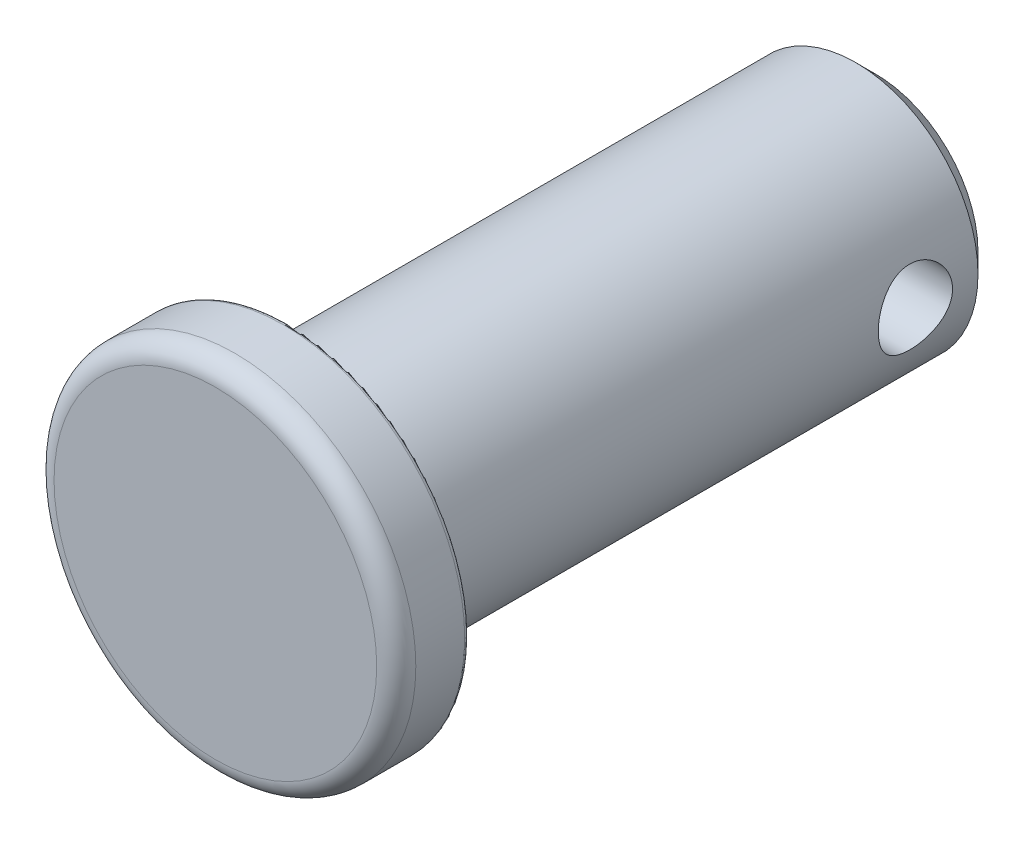
ISO-10303-21;
HEADER;
FILE_DESCRIPTION(('STEP AP214'),'2;1');
FILE_NAME('part.step','',(''),(''),'','','');
FILE_SCHEMA(('AUTOMOTIVE_DESIGN { 1 0 10303 214 1 1 1 1 }'));
ENDSEC;
DATA;
#1=APPLICATION_CONTEXT('core data for automotive mechanical design processes');
#2=APPLICATION_PROTOCOL_DEFINITION('international standard','automotive_design',2000,#1);
#3=PRODUCT_CONTEXT('',#1,'mechanical');
#4=PRODUCT('Part','Part','',(#3));
#5=PRODUCT_RELATED_PRODUCT_CATEGORY('part','',(#4));
#6=PRODUCT_DEFINITION_FORMATION('','',#4);
#7=PRODUCT_DEFINITION_CONTEXT('part definition',#1,'design');
#8=PRODUCT_DEFINITION('design','',#6,#7);
#9=PRODUCT_DEFINITION_SHAPE('','',#8);
#10=(LENGTH_UNIT() NAMED_UNIT(*) SI_UNIT(.MILLI.,.METRE.));
#11=(NAMED_UNIT(*) PLANE_ANGLE_UNIT() SI_UNIT($,.RADIAN.));
#12=(NAMED_UNIT(*) SI_UNIT($,.STERADIAN.) SOLID_ANGLE_UNIT());
#13=UNCERTAINTY_MEASURE_WITH_UNIT(LENGTH_MEASURE(1.E-05),#10,'distance_accuracy_value','');
#14=(GEOMETRIC_REPRESENTATION_CONTEXT(3) GLOBAL_UNCERTAINTY_ASSIGNED_CONTEXT((#13)) GLOBAL_UNIT_ASSIGNED_CONTEXT((#10,
#11,#12)) REPRESENTATION_CONTEXT('',''));
#15=CARTESIAN_POINT('',(0.,0.,0.));
#16=DIRECTION('',(0.,0.,1.));
#17=DIRECTION('',(1.,0.,0.));
#18=AXIS2_PLACEMENT_3D('',#15,#16,#17);
#19=CARTESIAN_POINT('',(0.,2.667,-17.145));
#20=DIRECTION('',(0.,0.,1.));
#21=DIRECTION('',(1.,0.,0.));
#22=AXIS2_PLACEMENT_3D('',#19,#20,#21);
#23=PLANE('',#22);
#24=CARTESIAN_POINT('',(0.,0.,-17.145));
#25=DIRECTION('',(0.,0.,1.));
#26=DIRECTION('',(1.,0.,0.));
#27=AXIS2_PLACEMENT_3D('',#24,#25,#26);
#28=CIRCLE('',#27,2.667);
#29=CARTESIAN_POINT('',(2.667,0.,-17.145));
#30=VERTEX_POINT('',#29);
#31=EDGE_CURVE('E10',#30,#30,#28,.T.);
#32=ORIENTED_EDGE('',*,*,#31,.F.);
#33=EDGE_LOOP('',(#32));
#34=FACE_BOUND('',#33,.T.);
#35=ADVANCED_FACE('F32',(#34),#23,.F.);
#36=CARTESIAN_POINT('',(0.,0.,-17.145));
#37=DIRECTION('',(0.,0.,1.));
#38=DIRECTION('',(1.,0.,0.));
#39=AXIS2_PLACEMENT_3D('',#36,#37,#38);
#40=CONICAL_SURFACE('',#39,2.667,0.78539816339745);
#41=CARTESIAN_POINT('',(0.,0.,-16.637));
#42=DIRECTION('',(0.,0.,1.));
#43=DIRECTION('',(1.,0.,0.));
#44=AXIS2_PLACEMENT_3D('',#41,#42,#43);
#45=CIRCLE('',#44,3.175);
#46=CARTESIAN_POINT('',(3.175,0.,-16.637));
#47=VERTEX_POINT('',#46);
#48=EDGE_CURVE('E43',#47,#47,#45,.T.);
#49=ORIENTED_EDGE('',*,*,#48,.F.);
#50=EDGE_LOOP('',(#49));
#51=FACE_BOUND('',#50,.T.);
#52=ORIENTED_EDGE('',*,*,#31,.T.);
#53=EDGE_LOOP('',(#52));
#54=FACE_BOUND('',#53,.T.);
#55=ADVANCED_FACE('F85',(#51,#54),#40,.T.);
#56=CARTESIAN_POINT('',(0.,0.,0.));
#57=DIRECTION('',(0.,0.,1.));
#58=DIRECTION('',(1.,0.,0.));
#59=AXIS2_PLACEMENT_3D('',#56,#57,#58);
#60=CYLINDRICAL_SURFACE('',#59,3.175);
#61=CARTESIAN_POINT('',(3.175,0.,-15.9766));
#62=CARTESIAN_POINT('',(3.17499960202148,-0.0529171099597264,-15.9765994489505));
#63=CARTESIAN_POINT('',(3.17366446482855,-0.105839807352675,-15.9722338271799));
#64=CARTESIAN_POINT('',(3.16846889178415,-0.21014197840556,-15.9549294973829));
#65=CARTESIAN_POINT('',(3.16460776043548,-0.261521022966031,-15.9419884282142));
#66=CARTESIAN_POINT('',(3.15478287039985,-0.361216525332734,-15.908006720182));
#67=CARTESIAN_POINT('',(3.14882226340518,-0.40953744637008,-15.8869782176925));
#68=CARTESIAN_POINT('',(3.13541665926723,-0.50196744325853,-15.8374689245118));
#69=CARTESIAN_POINT('',(3.12797145297021,-0.546075924355046,-15.8089870836004));
#70=CARTESIAN_POINT('',(3.11214479264708,-0.630125840429245,-15.7444975611919));
#71=CARTESIAN_POINT('',(3.103743765165,-0.669925978102081,-15.7083105430531));
#72=CARTESIAN_POINT('',(3.08706799446787,-0.742996439425313,-15.6298199866198));
#73=CARTESIAN_POINT('',(3.07879327343172,-0.776265628160733,-15.5875153874575));
#74=CARTESIAN_POINT('',(3.06309899900208,-0.836080473160604,-15.4967862419132));
#75=CARTESIAN_POINT('',(3.05570371684317,-0.862452386391713,-15.4482425580905));
#76=CARTESIAN_POINT('',(3.0428987677011,-0.906600393615938,-15.3471481631174));
#77=CARTESIAN_POINT('',(3.0374886094688,-0.924378614595107,-15.2945984472136));
#78=CARTESIAN_POINT('',(3.02947068370596,-0.950322690583481,-15.1885728272399));
#79=CARTESIAN_POINT('',(3.02678700868069,-0.958749553236373,-15.1351666869223));
#80=CARTESIAN_POINT('',(3.02430022666584,-0.966566860643121,-15.0276364102489));
#81=CARTESIAN_POINT('',(3.02449640053699,-0.965959561355332,-14.9735124565139));
#82=CARTESIAN_POINT('',(3.02767996420842,-0.955930519797648,-14.8682169177647));
#83=CARTESIAN_POINT('',(3.0305633238113,-0.946837279944035,-14.8170103750321));
#84=CARTESIAN_POINT('',(3.03862785484783,-0.920625823528376,-14.7168870607177));
#85=CARTESIAN_POINT('',(3.04380925854751,-0.903506795780515,-14.6679705211419));
#86=CARTESIAN_POINT('',(3.0559680411157,-0.861490913100131,-14.5730188964709));
#87=CARTESIAN_POINT('',(3.0629695326536,-0.83648859212139,-14.5270336996585));
#88=CARTESIAN_POINT('',(3.07796818060115,-0.77948913090951,-14.4398022103445));
#89=CARTESIAN_POINT('',(3.08596558363484,-0.747490256585575,-14.3985570965425));
#90=CARTESIAN_POINT('',(3.10247541142566,-0.675780693253499,-14.3201152659527));
#91=CARTESIAN_POINT('',(3.11099520450717,-0.635797838234663,-14.283168469916));
#92=CARTESIAN_POINT('',(3.12728596172095,-0.550097642371093,-14.2164453730147));
#93=CARTESIAN_POINT('',(3.13505687614133,-0.504379921298845,-14.1866695479755));
#94=CARTESIAN_POINT('',(3.14904855416768,-0.408044876414197,-14.1349763498454));
#95=CARTESIAN_POINT('',(3.15525802772192,-0.357395346141192,-14.1131157353477));
#96=CARTESIAN_POINT('',(3.16534578599812,-0.252905754376243,-14.0782977058135));
#97=CARTESIAN_POINT('',(3.16922473905631,-0.199066612457235,-14.0653377381367));
#98=CARTESIAN_POINT('',(3.17410811397315,-0.0918497008877941,-14.0491080126878));
#99=CARTESIAN_POINT('',(3.17521293054221,-0.0385276814501678,-14.0454996616508));
#100=CARTESIAN_POINT('',(3.17471884041293,0.0679641305281534,-14.0471247878636));
#101=CARTESIAN_POINT('',(3.17312030531726,0.121133942984885,-14.0523570498828));
#102=CARTESIAN_POINT('',(3.16746492711847,0.224525218303078,-14.0712417027748));
#103=CARTESIAN_POINT('',(3.16346622012139,0.274786510435966,-14.0846950993332));
#104=CARTESIAN_POINT('',(3.15347486502412,0.372326561352523,-14.1193996379704));
#105=CARTESIAN_POINT('',(3.14748197500806,0.419604957450587,-14.1406517261466));
#106=CARTESIAN_POINT('',(3.13394604455932,0.511073978477804,-14.1909113396242));
#107=CARTESIAN_POINT('',(3.12636983516459,0.555165721875379,-14.2200896475783));
#108=CARTESIAN_POINT('',(3.11053600304834,0.637941803466516,-14.2851667472226));
#109=CARTESIAN_POINT('',(3.10227820535769,0.676624746269282,-14.3210672675773));
#110=CARTESIAN_POINT('',(3.08562471680055,0.748983697946579,-14.4001611706546));
#111=CARTESIAN_POINT('',(3.07723539999955,0.782418659059277,-14.443576903662));
#112=CARTESIAN_POINT('',(3.06159477827646,0.841546870967973,-14.5355851719071));
#113=CARTESIAN_POINT('',(3.05434344692898,0.867240301544484,-14.5841775868917));
#114=CARTESIAN_POINT('',(3.04188247469256,0.90998492163134,-14.6850212346239));
#115=CARTESIAN_POINT('',(3.03666381180963,0.927074401040993,-14.7372550575976));
#116=CARTESIAN_POINT('',(3.02889265300242,0.952160759306612,-14.8440481997207));
#117=CARTESIAN_POINT('',(3.02633921201391,0.960160861264963,-14.8986066874171));
#118=CARTESIAN_POINT('',(3.02428242481225,0.96661829274199,-15.0059913814865));
#119=CARTESIAN_POINT('',(3.02465323006668,0.965469341614603,-15.0587918057839));
#120=CARTESIAN_POINT('',(3.02809958388935,0.954604456015092,-15.1634092265238));
#121=CARTESIAN_POINT('',(3.03117501865302,0.944888882006633,-15.2152262642513));
#122=CARTESIAN_POINT('',(3.03959856215796,0.917423724255598,-15.3157433473823));
#123=CARTESIAN_POINT('',(3.04491637331696,0.899781045503216,-15.3644753314018));
#124=CARTESIAN_POINT('',(3.05721921822302,0.857045987408373,-15.4583265041777));
#125=CARTESIAN_POINT('',(3.06420457754325,0.83195215306395,-15.5034449851311));
#126=CARTESIAN_POINT('',(3.07938049658697,0.773931856895504,-15.59060866113));
#127=CARTESIAN_POINT('',(3.08760628271673,0.740748228480038,-15.6324765335506));
#128=CARTESIAN_POINT('',(3.10416806483213,0.667949903798329,-15.7101771449288));
#129=CARTESIAN_POINT('',(3.11250408915778,0.628333523073051,-15.7460082981103));
#130=CARTESIAN_POINT('',(3.12864996888669,0.542348992657398,-15.8117018512508));
#131=CARTESIAN_POINT('',(3.13643622907422,0.495812639665194,-15.8413505090504));
#132=CARTESIAN_POINT('',(3.15031800168414,0.398179110176869,-15.8923623799248));
#133=CARTESIAN_POINT('',(3.15641426520088,0.347083973155336,-15.9137292753946));
#134=CARTESIAN_POINT('',(3.16573069212427,0.247063057460826,-15.9457698756868));
#135=CARTESIAN_POINT('',(3.16917750158742,0.198431287913334,-15.9572992255072));
#136=CARTESIAN_POINT('',(3.17381214254276,0.0998678490440652,-15.972713868313));
#137=CARTESIAN_POINT('',(3.17500037556131,0.0499364123754632,-15.9766005200102));
#138=CARTESIAN_POINT('',(3.175,0.,-15.9766));
#139=B_SPLINE_CURVE_WITH_KNOTS('',3,(#61,#62,#63,#64,#65,#66,#67,#68,#69,#70,#71,#72,#73,#74,
#75,#76,#77,#78,#79,#80,#81,#82,#83,#84,#85,#86,#87,#88,#89,#90,#91,#92,#93,#94,#95,#96,#97,#98,
#99,#100,#101,#102,#103,#104,#105,#106,#107,#108,#109,#110,#111,#112,#113,#114,#115,#116,#117,
#118,#119,#120,#121,#122,#123,#124,#125,#126,#127,#128,#129,#130,#131,#132,#133,#134,#135,#136,
#137,#138),.UNSPECIFIED.,.T.,.F.,(4,2,2,2,2,2,2,2,2,2,2,2,2,2,2,2,2,2,2,2,2,2,2,2,2,2,2,2,2,2,2,
2,2,2,2,2,2,2,4),(0.,0.158567863518892,0.317179404868527,0.475553849369922,0.633950621809959,
0.7965423613965,0.959162330382842,1.12555213721573,1.29190074054381,1.45347946625597,
1.61501784414631,1.77055128404458,1.9261004474744,2.08382584560656,2.24159038026939,
2.40613001083721,2.5706805563233,2.73638872963979,2.90204935919771,3.06162231521158,
3.22117333811235,3.37700747097253,3.53286051508764,3.69238225025491,3.85194506404332,
4.01746906847746,4.18298922867378,4.34776612032905,4.51248456367862,4.67015410642876,
4.82781701512603,4.98341468860239,5.13904276594956,5.30047374427453,5.46194706274889,
5.62831287823051,5.7946046358815,5.9442673501846,6.09390345518356),.UNSPECIFIED.);
#140=CARTESIAN_POINT('',(3.175,0.,-15.9766));
#141=VERTEX_POINT('',#140);
#142=EDGE_CURVE('E35',#141,#141,#139,.T.);
#143=ORIENTED_EDGE('',*,*,#142,.T.);
#144=EDGE_LOOP('',(#143));
#145=FACE_BOUND('',#144,.T.);
#146=CARTESIAN_POINT('',(-3.175,0.,-15.9766));
#147=CARTESIAN_POINT('',(-3.17499960202148,0.0529171099597264,-15.9765994489505));
#148=CARTESIAN_POINT('',(-3.17366446482855,0.105839807352675,-15.9722338271799));
#149=CARTESIAN_POINT('',(-3.16846889178415,0.21014197840556,-15.9549294973829));
#150=CARTESIAN_POINT('',(-3.16460776043548,0.261521022966031,-15.9419884282142));
#151=CARTESIAN_POINT('',(-3.15478287039985,0.361216525332734,-15.908006720182));
#152=CARTESIAN_POINT('',(-3.14882226340518,0.40953744637008,-15.8869782176925));
#153=CARTESIAN_POINT('',(-3.13541665926723,0.50196744325853,-15.8374689245118));
#154=CARTESIAN_POINT('',(-3.12797145297021,0.546075924355046,-15.8089870836004));
#155=CARTESIAN_POINT('',(-3.11214479264708,0.630125840429245,-15.7444975611919));
#156=CARTESIAN_POINT('',(-3.103743765165,0.669925978102081,-15.7083105430531));
#157=CARTESIAN_POINT('',(-3.08706799446787,0.742996439425313,-15.6298199866198));
#158=CARTESIAN_POINT('',(-3.07879327343172,0.776265628160733,-15.5875153874575));
#159=CARTESIAN_POINT('',(-3.06309899900208,0.836080473160604,-15.4967862419132));
#160=CARTESIAN_POINT('',(-3.05570371684317,0.862452386391713,-15.4482425580905));
#161=CARTESIAN_POINT('',(-3.0428987677011,0.906600393615938,-15.3471481631174));
#162=CARTESIAN_POINT('',(-3.0374886094688,0.924378614595107,-15.2945984472136));
#163=CARTESIAN_POINT('',(-3.02947068370596,0.950322690583481,-15.1885728272399));
#164=CARTESIAN_POINT('',(-3.02678700868069,0.958749553236373,-15.1351666869223));
#165=CARTESIAN_POINT('',(-3.02430022666584,0.966566860643121,-15.0276364102489));
#166=CARTESIAN_POINT('',(-3.02449640053699,0.965959561355332,-14.9735124565139));
#167=CARTESIAN_POINT('',(-3.02767996420842,0.955930519797648,-14.8682169177647));
#168=CARTESIAN_POINT('',(-3.0305633238113,0.946837279944035,-14.8170103750321));
#169=CARTESIAN_POINT('',(-3.03862785484783,0.920625823528376,-14.7168870607177));
#170=CARTESIAN_POINT('',(-3.04380925854751,0.903506795780515,-14.6679705211419));
#171=CARTESIAN_POINT('',(-3.0559680411157,0.861490913100131,-14.5730188964709));
#172=CARTESIAN_POINT('',(-3.0629695326536,0.83648859212139,-14.5270336996585));
#173=CARTESIAN_POINT('',(-3.07796818060115,0.77948913090951,-14.4398022103445));
#174=CARTESIAN_POINT('',(-3.08596558363484,0.747490256585575,-14.3985570965425));
#175=CARTESIAN_POINT('',(-3.10247541142566,0.675780693253499,-14.3201152659527));
#176=CARTESIAN_POINT('',(-3.11099520450717,0.635797838234663,-14.283168469916));
#177=CARTESIAN_POINT('',(-3.12728596172095,0.550097642371093,-14.2164453730147));
#178=CARTESIAN_POINT('',(-3.13505687614133,0.504379921298845,-14.1866695479755));
#179=CARTESIAN_POINT('',(-3.14904855416768,0.408044876414197,-14.1349763498454));
#180=CARTESIAN_POINT('',(-3.15525802772192,0.357395346141192,-14.1131157353477));
#181=CARTESIAN_POINT('',(-3.16534578599812,0.252905754376243,-14.0782977058135));
#182=CARTESIAN_POINT('',(-3.16922473905631,0.199066612457235,-14.0653377381367));
#183=CARTESIAN_POINT('',(-3.17410811397315,0.0918497008877941,-14.0491080126878));
#184=CARTESIAN_POINT('',(-3.17521293054221,0.0385276814501678,-14.0454996616508));
#185=CARTESIAN_POINT('',(-3.17471884041293,-0.0679641305281534,-14.0471247878636));
#186=CARTESIAN_POINT('',(-3.17312030531726,-0.121133942984885,-14.0523570498828));
#187=CARTESIAN_POINT('',(-3.16746492711847,-0.224525218303078,-14.0712417027748));
#188=CARTESIAN_POINT('',(-3.16346622012139,-0.274786510435966,-14.0846950993332));
#189=CARTESIAN_POINT('',(-3.15347486502412,-0.372326561352523,-14.1193996379704));
#190=CARTESIAN_POINT('',(-3.14748197500806,-0.419604957450587,-14.1406517261466));
#191=CARTESIAN_POINT('',(-3.13394604455932,-0.511073978477804,-14.1909113396242));
#192=CARTESIAN_POINT('',(-3.12636983516459,-0.555165721875379,-14.2200896475783));
#193=CARTESIAN_POINT('',(-3.11053600304834,-0.637941803466516,-14.2851667472226));
#194=CARTESIAN_POINT('',(-3.10227820535769,-0.676624746269282,-14.3210672675773));
#195=CARTESIAN_POINT('',(-3.08562471680055,-0.748983697946579,-14.4001611706546));
#196=CARTESIAN_POINT('',(-3.07723539999955,-0.782418659059277,-14.443576903662));
#197=CARTESIAN_POINT('',(-3.06159477827646,-0.841546870967973,-14.5355851719071));
#198=CARTESIAN_POINT('',(-3.05434344692898,-0.867240301544484,-14.5841775868917));
#199=CARTESIAN_POINT('',(-3.04188247469256,-0.90998492163134,-14.6850212346239));
#200=CARTESIAN_POINT('',(-3.03666381180963,-0.927074401040993,-14.7372550575976));
#201=CARTESIAN_POINT('',(-3.02889265300242,-0.952160759306612,-14.8440481997207));
#202=CARTESIAN_POINT('',(-3.02633921201391,-0.960160861264963,-14.8986066874171));
#203=CARTESIAN_POINT('',(-3.02428242481225,-0.96661829274199,-15.0059913814865));
#204=CARTESIAN_POINT('',(-3.02465323006668,-0.965469341614603,-15.0587918057839));
#205=CARTESIAN_POINT('',(-3.02809958388935,-0.954604456015092,-15.1634092265238));
#206=CARTESIAN_POINT('',(-3.03117501865302,-0.944888882006633,-15.2152262642513));
#207=CARTESIAN_POINT('',(-3.03959856215796,-0.917423724255598,-15.3157433473823));
#208=CARTESIAN_POINT('',(-3.04491637331696,-0.899781045503216,-15.3644753314018));
#209=CARTESIAN_POINT('',(-3.05721921822302,-0.857045987408373,-15.4583265041777));
#210=CARTESIAN_POINT('',(-3.06420457754325,-0.83195215306395,-15.5034449851311));
#211=CARTESIAN_POINT('',(-3.07938049658697,-0.773931856895504,-15.59060866113));
#212=CARTESIAN_POINT('',(-3.08760628271673,-0.740748228480038,-15.6324765335506));
#213=CARTESIAN_POINT('',(-3.10416806483213,-0.667949903798329,-15.7101771449288));
#214=CARTESIAN_POINT('',(-3.11250408915778,-0.628333523073051,-15.7460082981103));
#215=CARTESIAN_POINT('',(-3.12864996888669,-0.542348992657398,-15.8117018512508));
#216=CARTESIAN_POINT('',(-3.13643622907422,-0.495812639665194,-15.8413505090504));
#217=CARTESIAN_POINT('',(-3.15031800168414,-0.398179110176869,-15.8923623799248));
#218=CARTESIAN_POINT('',(-3.15641426520088,-0.347083973155336,-15.9137292753946));
#219=CARTESIAN_POINT('',(-3.16573069212427,-0.247063057460826,-15.9457698756868));
#220=CARTESIAN_POINT('',(-3.16917750158742,-0.198431287913334,-15.9572992255072));
#221=CARTESIAN_POINT('',(-3.17381214254276,-0.0998678490440652,-15.972713868313));
#222=CARTESIAN_POINT('',(-3.17500037556131,-0.0499364123754632,-15.9766005200102));
#223=CARTESIAN_POINT('',(-3.175,0.,-15.9766));
#224=B_SPLINE_CURVE_WITH_KNOTS('',3,(#146,#147,#148,#149,#150,#151,#152,#153,#154,#155,#156,
#157,#158,#159,#160,#161,#162,#163,#164,#165,#166,#167,#168,#169,#170,#171,#172,#173,#174,#175,
#176,#177,#178,#179,#180,#181,#182,#183,#184,#185,#186,#187,#188,#189,#190,#191,#192,#193,#194,
#195,#196,#197,#198,#199,#200,#201,#202,#203,#204,#205,#206,#207,#208,#209,#210,#211,#212,#213,
#214,#215,#216,#217,#218,#219,#220,#221,#222,#223),.UNSPECIFIED.,.T.,.F.,(4,2,2,2,2,2,2,2,2,2,2,
2,2,2,2,2,2,2,2,2,2,2,2,2,2,2,2,2,2,2,2,2,2,2,2,2,2,2,4),(0.,0.158567863518892,
0.317179404868527,0.475553849369922,0.633950621809959,0.7965423613965,0.959162330382842,
1.12555213721573,1.29190074054381,1.45347946625597,1.61501784414631,1.77055128404458,
1.9261004474744,2.08382584560656,2.24159038026939,2.40613001083721,2.5706805563233,
2.73638872963979,2.90204935919771,3.06162231521158,3.22117333811235,3.37700747097253,
3.53286051508764,3.69238225025491,3.85194506404332,4.01746906847746,4.18298922867378,
4.34776612032905,4.51248456367862,4.67015410642876,4.82781701512603,4.98341468860239,
5.13904276594956,5.30047374427453,5.46194706274889,5.62831287823051,5.7946046358815,
5.9442673501846,6.09390345518356),.UNSPECIFIED.);
#225=CARTESIAN_POINT('',(-3.175,0.,-15.9766));
#226=VERTEX_POINT('',#225);
#227=EDGE_CURVE('E51',#226,#226,#224,.T.);
#228=ORIENTED_EDGE('',*,*,#227,.T.);
#229=EDGE_LOOP('',(#228));
#230=FACE_BOUND('',#229,.T.);
#231=CARTESIAN_POINT('',(0.,0.,-1.905));
#232=DIRECTION('',(0.,0.,1.));
#233=DIRECTION('',(1.,0.,0.));
#234=AXIS2_PLACEMENT_3D('',#231,#232,#233);
#235=CIRCLE('',#234,3.175);
#236=CARTESIAN_POINT('',(3.175,0.,-1.905));
#237=VERTEX_POINT('',#236);
#238=EDGE_CURVE('E48',#237,#237,#235,.T.);
#239=ORIENTED_EDGE('',*,*,#238,.F.);
#240=EDGE_LOOP('',(#239));
#241=FACE_BOUND('',#240,.T.);
#242=ORIENTED_EDGE('',*,*,#48,.T.);
#243=EDGE_LOOP('',(#242));
#244=FACE_BOUND('',#243,.T.);
#245=ADVANCED_FACE('F55',(#145,#230,#241,#244),#60,.T.);
#246=CARTESIAN_POINT('',(0.,4.572,-1.905));
#247=DIRECTION('',(0.,0.,1.));
#248=DIRECTION('',(1.,0.,0.));
#249=AXIS2_PLACEMENT_3D('',#246,#247,#248);
#250=PLANE('',#249);
#251=CARTESIAN_POINT('',(0.,0.,-1.905));
#252=DIRECTION('',(0.,0.,1.));
#253=DIRECTION('',(1.,0.,0.));
#254=AXIS2_PLACEMENT_3D('',#251,#252,#253);
#255=CIRCLE('',#254,4.572);
#256=CARTESIAN_POINT('',(4.572,0.,-1.905));
#257=VERTEX_POINT('',#256);
#258=EDGE_CURVE('E148',#257,#257,#255,.T.);
#259=ORIENTED_EDGE('',*,*,#258,.F.);
#260=EDGE_LOOP('',(#259));
#261=FACE_BOUND('',#260,.T.);
#262=ORIENTED_EDGE('',*,*,#238,.T.);
#263=EDGE_LOOP('',(#262));
#264=FACE_BOUND('',#263,.T.);
#265=ADVANCED_FACE('F78',(#261,#264),#250,.F.);
#266=CARTESIAN_POINT('',(0.,0.,-1.778));
#267=DIRECTION('',(0.,0.,1.));
#268=DIRECTION('',(1.,0.,0.));
#269=AXIS2_PLACEMENT_3D('',#266,#267,#268);
#270=TOROIDAL_SURFACE('',#269,4.572,0.127);
#271=CARTESIAN_POINT('',(0.,0.,-1.778));
#272=DIRECTION('',(0.,0.,1.));
#273=DIRECTION('',(1.,0.,0.));
#274=AXIS2_PLACEMENT_3D('',#271,#272,#273);
#275=CIRCLE('',#274,4.699);
#276=CARTESIAN_POINT('',(4.699,0.,-1.778));
#277=VERTEX_POINT('',#276);
#278=EDGE_CURVE('E152',#277,#277,#275,.T.);
#279=ORIENTED_EDGE('',*,*,#278,.F.);
#280=EDGE_LOOP('',(#279));
#281=FACE_BOUND('',#280,.T.);
#282=ORIENTED_EDGE('',*,*,#258,.T.);
#283=EDGE_LOOP('',(#282));
#284=FACE_BOUND('',#283,.T.);
#285=ADVANCED_FACE('F75',(#281,#284),#270,.T.);
#286=CARTESIAN_POINT('',(0.,0.,0.));
#287=DIRECTION('',(0.,0.,1.));
#288=DIRECTION('',(1.,0.,0.));
#289=AXIS2_PLACEMENT_3D('',#286,#287,#288);
#290=CYLINDRICAL_SURFACE('',#289,4.699);
#291=CARTESIAN_POINT('',(0.,0.,-0.508));
#292=DIRECTION('',(0.,0.,1.));
#293=DIRECTION('',(1.,0.,0.));
#294=AXIS2_PLACEMENT_3D('',#291,#292,#293);
#295=CIRCLE('',#294,4.699);
#296=CARTESIAN_POINT('',(4.699,0.,-0.508));
#297=VERTEX_POINT('',#296);
#298=EDGE_CURVE('E157',#297,#297,#295,.T.);
#299=ORIENTED_EDGE('',*,*,#298,.F.);
#300=EDGE_LOOP('',(#299));
#301=FACE_BOUND('',#300,.T.);
#302=ORIENTED_EDGE('',*,*,#278,.T.);
#303=EDGE_LOOP('',(#302));
#304=FACE_BOUND('',#303,.T.);
#305=ADVANCED_FACE('F71',(#301,#304),#290,.T.);
#306=CARTESIAN_POINT('',(0.,0.,-0.508));
#307=DIRECTION('',(0.,0.,1.));
#308=DIRECTION('',(1.,0.,0.));
#309=AXIS2_PLACEMENT_3D('',#306,#307,#308);
#310=TOROIDAL_SURFACE('',#309,4.191,0.508);
#311=CARTESIAN_POINT('',(0.,0.,0.));
#312=DIRECTION('',(0.,0.,1.));
#313=DIRECTION('',(1.,0.,0.));
#314=AXIS2_PLACEMENT_3D('',#311,#312,#313);
#315=CIRCLE('',#314,4.191);
#316=CARTESIAN_POINT('',(4.191,0.,0.));
#317=VERTEX_POINT('',#316);
#318=EDGE_CURVE('E160',#317,#317,#315,.T.);
#319=ORIENTED_EDGE('',*,*,#318,.F.);
#320=EDGE_LOOP('',(#319));
#321=FACE_BOUND('',#320,.T.);
#322=ORIENTED_EDGE('',*,*,#298,.T.);
#323=EDGE_LOOP('',(#322));
#324=FACE_BOUND('',#323,.T.);
#325=ADVANCED_FACE('F67',(#321,#324),#310,.T.);
#326=CARTESIAN_POINT('',(0.,0.,0.));
#327=DIRECTION('',(0.,0.,-1.));
#328=DIRECTION('',(-1.,0.,0.));
#329=AXIS2_PLACEMENT_3D('',#326,#327,#328);
#330=PLANE('',#329);
#331=ORIENTED_EDGE('',*,*,#318,.T.);
#332=EDGE_LOOP('',(#331));
#333=FACE_BOUND('',#332,.T.);
#334=ADVANCED_FACE('F62',(#333),#330,.F.);
#335=CARTESIAN_POINT('',(-4.699,0.,-15.0114));
#336=DIRECTION('',(1.,0.,0.));
#337=DIRECTION('',(0.,0.,-1.));
#338=AXIS2_PLACEMENT_3D('',#335,#336,#337);
#339=CYLINDRICAL_SURFACE('',#338,0.965199999999996);
#340=ORIENTED_EDGE('',*,*,#227,.F.);
#341=EDGE_LOOP('',(#340));
#342=FACE_BOUND('',#341,.T.);
#343=ORIENTED_EDGE('',*,*,#142,.F.);
#344=EDGE_LOOP('',(#343));
#345=FACE_BOUND('',#344,.T.);
#346=ADVANCED_FACE('F58',(#342,#345),#339,.F.);
#347=CLOSED_SHELL('',(#35,#55,#245,#265,#285,#305,#325,#334,#346));
#348=MANIFOLD_SOLID_BREP('B2',#347);
#349=ADVANCED_BREP_SHAPE_REPRESENTATION('',(#18,#348),#14);
#350=SHAPE_DEFINITION_REPRESENTATION(#9,#349);
ENDSEC;
END-ISO-10303-21;
